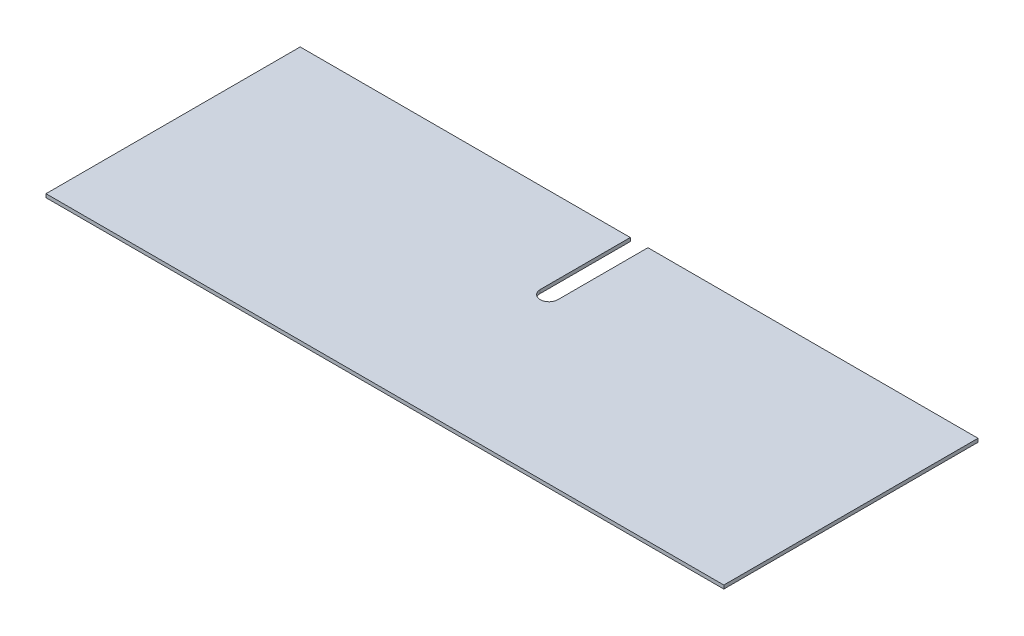
ISO-10303-21;
HEADER;
FILE_DESCRIPTION(('STEP AP214'),'2;1');
FILE_NAME('part.step','',(''),(''),'','','');
FILE_SCHEMA(('AUTOMOTIVE_DESIGN { 1 0 10303 214 1 1 1 1 }'));
ENDSEC;
DATA;
#1=APPLICATION_CONTEXT('core data for automotive mechanical design processes');
#2=APPLICATION_PROTOCOL_DEFINITION('international standard','automotive_design',2000,#1);
#3=PRODUCT_CONTEXT('',#1,'mechanical');
#4=PRODUCT('Part','Part','',(#3));
#5=PRODUCT_RELATED_PRODUCT_CATEGORY('part','',(#4));
#6=PRODUCT_DEFINITION_FORMATION('','',#4);
#7=PRODUCT_DEFINITION_CONTEXT('part definition',#1,'design');
#8=PRODUCT_DEFINITION('design','',#6,#7);
#9=PRODUCT_DEFINITION_SHAPE('','',#8);
#10=(LENGTH_UNIT() NAMED_UNIT(*) SI_UNIT(.MILLI.,.METRE.));
#11=(NAMED_UNIT(*) PLANE_ANGLE_UNIT() SI_UNIT($,.RADIAN.));
#12=(NAMED_UNIT(*) SI_UNIT($,.STERADIAN.) SOLID_ANGLE_UNIT());
#13=UNCERTAINTY_MEASURE_WITH_UNIT(LENGTH_MEASURE(1.E-05),#10,'distance_accuracy_value','');
#14=(GEOMETRIC_REPRESENTATION_CONTEXT(3) GLOBAL_UNCERTAINTY_ASSIGNED_CONTEXT((#13)) GLOBAL_UNIT_ASSIGNED_CONTEXT((#10,
#11,#12)) REPRESENTATION_CONTEXT('',''));
#15=CARTESIAN_POINT('',(0.,0.,0.));
#16=DIRECTION('',(0.,0.,1.));
#17=DIRECTION('',(1.,0.,0.));
#18=AXIS2_PLACEMENT_3D('',#15,#16,#17);
#19=CARTESIAN_POINT('',(0.,3.175,-228.6));
#20=DIRECTION('',(0.,0.,1.));
#21=DIRECTION('',(1.,0.,0.));
#22=AXIS2_PLACEMENT_3D('',#19,#20,#21);
#23=PLANE('',#22);
#24=DIRECTION('',(-1.,0.,0.));
#25=VECTOR('',#24,1.);
#26=CARTESIAN_POINT('',(0.,3.175,-228.6));
#27=LINE('',#26,#25);
#28=CARTESIAN_POINT('',(296.8625,3.175,-228.6));
#29=VERTEX_POINT('',#28);
#30=CARTESIAN_POINT('',(0.,3.175,-228.6));
#31=VERTEX_POINT('',#30);
#32=EDGE_CURVE('E57',#29,#31,#27,.T.);
#33=ORIENTED_EDGE('',*,*,#32,.F.);
#34=DIRECTION('',(0.,1.,0.));
#35=VECTOR('',#34,1.);
#36=CARTESIAN_POINT('',(296.8625,0.,-228.6));
#37=LINE('',#36,#35);
#38=CARTESIAN_POINT('',(296.8625,0.,-228.6));
#39=VERTEX_POINT('',#38);
#40=EDGE_CURVE('E133',#39,#29,#37,.T.);
#41=ORIENTED_EDGE('',*,*,#40,.F.);
#42=DIRECTION('',(-1.,0.,0.));
#43=VECTOR('',#42,1.);
#44=CARTESIAN_POINT('',(0.,0.,-228.6));
#45=LINE('',#44,#43);
#46=CARTESIAN_POINT('',(0.,0.,-228.6));
#47=VERTEX_POINT('',#46);
#48=EDGE_CURVE('E79',#39,#47,#45,.T.);
#49=ORIENTED_EDGE('',*,*,#48,.T.);
#50=DIRECTION('',(0.,-1.,0.));
#51=VECTOR('',#50,1.);
#52=CARTESIAN_POINT('',(0.,3.175,-228.6));
#53=LINE('',#52,#51);
#54=EDGE_CURVE('E149',#31,#47,#53,.T.);
#55=ORIENTED_EDGE('',*,*,#54,.F.);
#56=EDGE_LOOP('',(#33,#41,#49,#55));
#57=FACE_BOUND('',#56,.T.);
#58=ADVANCED_FACE('F33',(#57),#23,.F.);
#59=CARTESIAN_POINT('',(0.,3.175,0.));
#60=DIRECTION('',(1.,0.,0.));
#61=DIRECTION('',(0.,0.,-1.));
#62=AXIS2_PLACEMENT_3D('',#59,#60,#61);
#63=PLANE('',#62);
#64=DIRECTION('',(0.,0.,1.));
#65=VECTOR('',#64,1.);
#66=CARTESIAN_POINT('',(0.,0.,0.));
#67=LINE('',#66,#65);
#68=CARTESIAN_POINT('',(0.,0.,0.));
#69=VERTEX_POINT('',#68);
#70=EDGE_CURVE('E135',#47,#69,#67,.T.);
#71=ORIENTED_EDGE('',*,*,#70,.T.);
#72=DIRECTION('',(0.,-1.,0.));
#73=VECTOR('',#72,1.);
#74=CARTESIAN_POINT('',(0.,3.175,0.));
#75=LINE('',#74,#73);
#76=CARTESIAN_POINT('',(0.,3.175,0.));
#77=VERTEX_POINT('',#76);
#78=EDGE_CURVE('E11',#77,#69,#75,.T.);
#79=ORIENTED_EDGE('',*,*,#78,.F.);
#80=DIRECTION('',(0.,0.,1.));
#81=VECTOR('',#80,1.);
#82=CARTESIAN_POINT('',(0.,3.175,0.));
#83=LINE('',#82,#81);
#84=EDGE_CURVE('E140',#31,#77,#83,.T.);
#85=ORIENTED_EDGE('',*,*,#84,.F.);
#86=ORIENTED_EDGE('',*,*,#54,.T.);
#87=EDGE_LOOP('',(#71,#79,#85,#86));
#88=FACE_BOUND('',#87,.T.);
#89=ADVANCED_FACE('F35',(#88),#63,.F.);
#90=CARTESIAN_POINT('',(0.,3.175,0.));
#91=DIRECTION('',(0.,0.,-1.));
#92=DIRECTION('',(-1.,0.,0.));
#93=AXIS2_PLACEMENT_3D('',#90,#91,#92);
#94=PLANE('',#93);
#95=DIRECTION('',(1.,0.,0.));
#96=VECTOR('',#95,1.);
#97=CARTESIAN_POINT('',(0.,0.,0.));
#98=LINE('',#97,#96);
#99=CARTESIAN_POINT('',(609.6,0.,0.));
#100=VERTEX_POINT('',#99);
#101=EDGE_CURVE('E152',#69,#100,#98,.T.);
#102=ORIENTED_EDGE('',*,*,#101,.T.);
#103=DIRECTION('',(0.,-1.,0.));
#104=VECTOR('',#103,1.);
#105=CARTESIAN_POINT('',(609.6,3.175,0.));
#106=LINE('',#105,#104);
#107=CARTESIAN_POINT('',(609.6,3.175,0.));
#108=VERTEX_POINT('',#107);
#109=EDGE_CURVE('E41',#108,#100,#106,.T.);
#110=ORIENTED_EDGE('',*,*,#109,.F.);
#111=DIRECTION('',(1.,0.,0.));
#112=VECTOR('',#111,1.);
#113=CARTESIAN_POINT('',(0.,3.175,0.));
#114=LINE('',#113,#112);
#115=EDGE_CURVE('E86',#77,#108,#114,.T.);
#116=ORIENTED_EDGE('',*,*,#115,.F.);
#117=ORIENTED_EDGE('',*,*,#78,.T.);
#118=EDGE_LOOP('',(#102,#110,#116,#117));
#119=FACE_BOUND('',#118,.T.);
#120=ADVANCED_FACE('F176',(#119),#94,.F.);
#121=CARTESIAN_POINT('',(609.6,3.175,0.));
#122=DIRECTION('',(-1.,0.,0.));
#123=DIRECTION('',(0.,0.,1.));
#124=AXIS2_PLACEMENT_3D('',#121,#122,#123);
#125=PLANE('',#124);
#126=DIRECTION('',(0.,0.,-1.));
#127=VECTOR('',#126,1.);
#128=CARTESIAN_POINT('',(609.6,0.,0.));
#129=LINE('',#128,#127);
#130=CARTESIAN_POINT('',(609.6,0.,-228.6));
#131=VERTEX_POINT('',#130);
#132=EDGE_CURVE('E154',#100,#131,#129,.T.);
#133=ORIENTED_EDGE('',*,*,#132,.T.);
#134=DIRECTION('',(0.,-1.,0.));
#135=VECTOR('',#134,1.);
#136=CARTESIAN_POINT('',(609.6,3.175,-228.6));
#137=LINE('',#136,#135);
#138=CARTESIAN_POINT('',(609.6,3.175,-228.6));
#139=VERTEX_POINT('',#138);
#140=EDGE_CURVE('E159',#139,#131,#137,.T.);
#141=ORIENTED_EDGE('',*,*,#140,.F.);
#142=DIRECTION('',(0.,0.,-1.));
#143=VECTOR('',#142,1.);
#144=CARTESIAN_POINT('',(609.6,3.175,0.));
#145=LINE('',#144,#143);
#146=EDGE_CURVE('E144',#108,#139,#145,.T.);
#147=ORIENTED_EDGE('',*,*,#146,.F.);
#148=ORIENTED_EDGE('',*,*,#109,.T.);
#149=EDGE_LOOP('',(#133,#141,#147,#148));
#150=FACE_BOUND('',#149,.T.);
#151=ADVANCED_FACE('F165',(#150),#125,.F.);
#152=CARTESIAN_POINT('',(312.7375,0.,-228.6));
#153=VERTEX_POINT('',#152);
#154=EDGE_CURVE('E142',#131,#153,#45,.T.);
#155=ORIENTED_EDGE('',*,*,#154,.T.);
#156=DIRECTION('',(0.,1.,0.));
#157=VECTOR('',#156,1.);
#158=CARTESIAN_POINT('',(312.7375,0.,-228.6));
#159=LINE('',#158,#157);
#160=CARTESIAN_POINT('',(312.7375,3.175,-228.6));
#161=VERTEX_POINT('',#160);
#162=EDGE_CURVE('E136',#153,#161,#159,.T.);
#163=ORIENTED_EDGE('',*,*,#162,.T.);
#164=EDGE_CURVE('E146',#139,#161,#27,.T.);
#165=ORIENTED_EDGE('',*,*,#164,.F.);
#166=ORIENTED_EDGE('',*,*,#140,.T.);
#167=EDGE_LOOP('',(#155,#163,#165,#166));
#168=FACE_BOUND('',#167,.T.);
#169=ADVANCED_FACE('F169',(#168),#23,.F.);
#170=CARTESIAN_POINT('',(0.,3.175,0.));
#171=DIRECTION('',(0.,-1.,0.));
#172=DIRECTION('',(0.,0.,-1.));
#173=AXIS2_PLACEMENT_3D('',#170,#171,#172);
#174=PLANE('',#173);
#175=CARTESIAN_POINT('',(304.8,3.175,-147.6375));
#176=DIRECTION('',(0.,1.,0.));
#177=DIRECTION('',(0.,0.,1.));
#178=AXIS2_PLACEMENT_3D('',#175,#176,#177);
#179=CIRCLE('',#178,7.93750000000004);
#180=CARTESIAN_POINT('',(296.8625,3.175,-147.6375));
#181=VERTEX_POINT('',#180);
#182=CARTESIAN_POINT('',(312.7375,3.175,-147.6375));
#183=VERTEX_POINT('',#182);
#184=EDGE_CURVE('E127',#181,#183,#179,.T.);
#185=ORIENTED_EDGE('',*,*,#184,.F.);
#186=DIRECTION('',(0.,0.,1.));
#187=VECTOR('',#186,1.);
#188=CARTESIAN_POINT('',(296.8625,3.175,-228.6));
#189=LINE('',#188,#187);
#190=EDGE_CURVE('E112',#29,#181,#189,.T.);
#191=ORIENTED_EDGE('',*,*,#190,.F.);
#192=ORIENTED_EDGE('',*,*,#32,.T.);
#193=ORIENTED_EDGE('',*,*,#84,.T.);
#194=ORIENTED_EDGE('',*,*,#115,.T.);
#195=ORIENTED_EDGE('',*,*,#146,.T.);
#196=ORIENTED_EDGE('',*,*,#164,.T.);
#197=DIRECTION('',(0.,0.,-1.));
#198=VECTOR('',#197,1.);
#199=CARTESIAN_POINT('',(312.7375,3.175,-228.6));
#200=LINE('',#199,#198);
#201=EDGE_CURVE('E125',#183,#161,#200,.T.);
#202=ORIENTED_EDGE('',*,*,#201,.F.);
#203=EDGE_LOOP('',(#185,#191,#192,#193,#194,#195,#196,#202));
#204=FACE_BOUND('',#203,.T.);
#205=ADVANCED_FACE('F172',(#204),#174,.F.);
#206=CARTESIAN_POINT('',(0.,0.,0.));
#207=DIRECTION('',(0.,-1.,0.));
#208=DIRECTION('',(0.,0.,-1.));
#209=AXIS2_PLACEMENT_3D('',#206,#207,#208);
#210=PLANE('',#209);
#211=DIRECTION('',(0.,0.,1.));
#212=VECTOR('',#211,1.);
#213=CARTESIAN_POINT('',(296.8625,0.,-228.6));
#214=LINE('',#213,#212);
#215=CARTESIAN_POINT('',(296.8625,0.,-147.6375));
#216=VERTEX_POINT('',#215);
#217=EDGE_CURVE('E111',#39,#216,#214,.T.);
#218=ORIENTED_EDGE('',*,*,#217,.T.);
#219=CARTESIAN_POINT('',(304.8,0.,-147.6375));
#220=DIRECTION('',(0.,1.,0.));
#221=DIRECTION('',(0.,0.,1.));
#222=AXIS2_PLACEMENT_3D('',#219,#220,#221);
#223=CIRCLE('',#222,7.93750000000004);
#224=CARTESIAN_POINT('',(312.7375,0.,-147.6375));
#225=VERTEX_POINT('',#224);
#226=EDGE_CURVE('E119',#216,#225,#223,.T.);
#227=ORIENTED_EDGE('',*,*,#226,.T.);
#228=DIRECTION('',(0.,0.,-1.));
#229=VECTOR('',#228,1.);
#230=CARTESIAN_POINT('',(312.7375,0.,-228.6));
#231=LINE('',#230,#229);
#232=EDGE_CURVE('E48',#225,#153,#231,.T.);
#233=ORIENTED_EDGE('',*,*,#232,.T.);
#234=ORIENTED_EDGE('',*,*,#154,.F.);
#235=ORIENTED_EDGE('',*,*,#132,.F.);
#236=ORIENTED_EDGE('',*,*,#101,.F.);
#237=ORIENTED_EDGE('',*,*,#70,.F.);
#238=ORIENTED_EDGE('',*,*,#48,.F.);
#239=EDGE_LOOP('',(#218,#227,#233,#234,#235,#236,#237,#238));
#240=FACE_BOUND('',#239,.T.);
#241=ADVANCED_FACE('F123',(#240),#210,.T.);
#242=CARTESIAN_POINT('',(296.8625,0.,-228.6));
#243=DIRECTION('',(-1.,0.,0.));
#244=DIRECTION('',(0.,0.,1.));
#245=AXIS2_PLACEMENT_3D('',#242,#243,#244);
#246=PLANE('',#245);
#247=ORIENTED_EDGE('',*,*,#190,.T.);
#248=DIRECTION('',(0.,1.,0.));
#249=VECTOR('',#248,1.);
#250=CARTESIAN_POINT('',(296.8625,0.,-147.6375));
#251=LINE('',#250,#249);
#252=EDGE_CURVE('E107',#216,#181,#251,.T.);
#253=ORIENTED_EDGE('',*,*,#252,.F.);
#254=ORIENTED_EDGE('',*,*,#217,.F.);
#255=ORIENTED_EDGE('',*,*,#40,.T.);
#256=EDGE_LOOP('',(#247,#253,#254,#255));
#257=FACE_BOUND('',#256,.T.);
#258=ADVANCED_FACE('F109',(#257),#246,.F.);
#259=CARTESIAN_POINT('',(312.7375,0.,-228.6));
#260=DIRECTION('',(1.,0.,0.));
#261=DIRECTION('',(0.,0.,-1.));
#262=AXIS2_PLACEMENT_3D('',#259,#260,#261);
#263=PLANE('',#262);
#264=ORIENTED_EDGE('',*,*,#201,.T.);
#265=ORIENTED_EDGE('',*,*,#162,.F.);
#266=ORIENTED_EDGE('',*,*,#232,.F.);
#267=DIRECTION('',(0.,1.,0.));
#268=VECTOR('',#267,1.);
#269=CARTESIAN_POINT('',(312.7375,0.,-147.6375));
#270=LINE('',#269,#268);
#271=EDGE_CURVE('E116',#225,#183,#270,.T.);
#272=ORIENTED_EDGE('',*,*,#271,.T.);
#273=EDGE_LOOP('',(#264,#265,#266,#272));
#274=FACE_BOUND('',#273,.T.);
#275=ADVANCED_FACE('F199',(#274),#263,.F.);
#276=CARTESIAN_POINT('',(304.8,0.,-147.6375));
#277=DIRECTION('',(0.,1.,0.));
#278=DIRECTION('',(0.,0.,1.));
#279=AXIS2_PLACEMENT_3D('',#276,#277,#278);
#280=CYLINDRICAL_SURFACE('',#279,7.93750000000004);
#281=ORIENTED_EDGE('',*,*,#184,.T.);
#282=ORIENTED_EDGE('',*,*,#271,.F.);
#283=ORIENTED_EDGE('',*,*,#226,.F.);
#284=ORIENTED_EDGE('',*,*,#252,.T.);
#285=EDGE_LOOP('',(#281,#282,#283,#284));
#286=FACE_BOUND('',#285,.T.);
#287=ADVANCED_FACE('F120',(#286),#280,.F.);
#288=CLOSED_SHELL('',(#58,#89,#120,#151,#169,#205,#241,#258,#275,#287));
#289=MANIFOLD_SOLID_BREP('B2',#288);
#290=ADVANCED_BREP_SHAPE_REPRESENTATION('',(#18,#289),#14);
#291=SHAPE_DEFINITION_REPRESENTATION(#9,#290);
ENDSEC;
END-ISO-10303-21;
